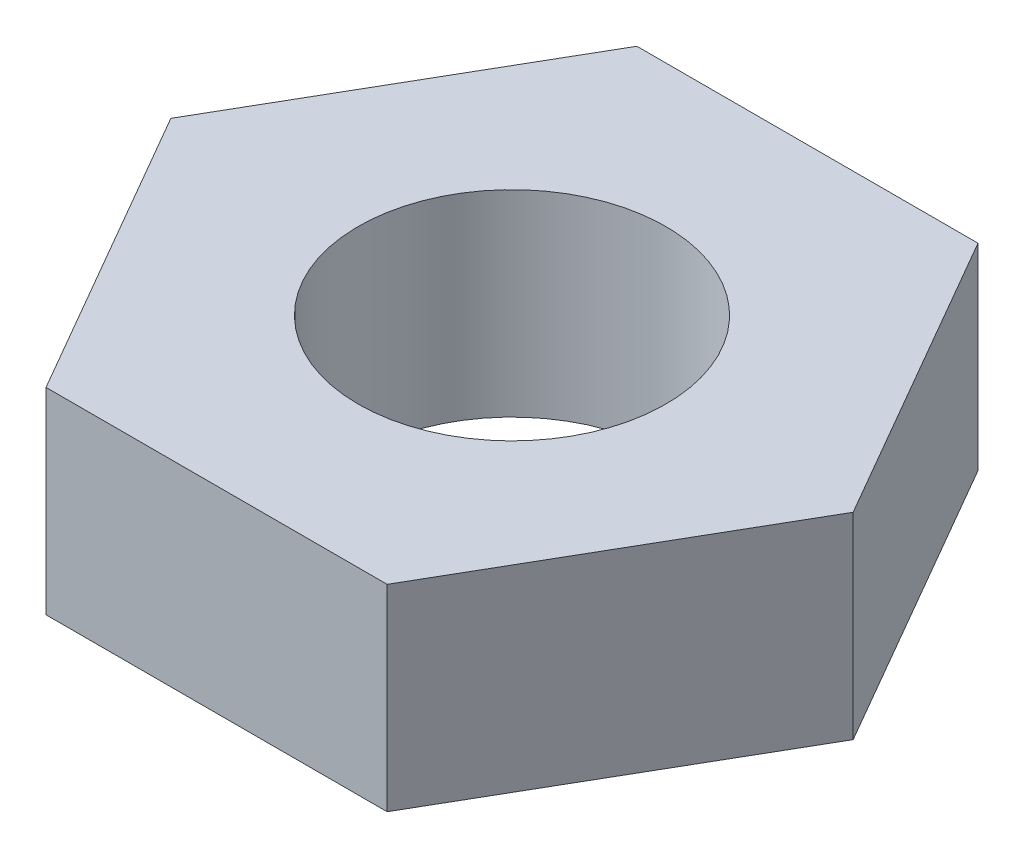
ISO-10303-21;
HEADER;
FILE_DESCRIPTION(('STEP AP214'),'2;1');
FILE_NAME('part.step','',(''),(''),'','','');
FILE_SCHEMA(('AUTOMOTIVE_DESIGN { 1 0 10303 214 1 1 1 1 }'));
ENDSEC;
DATA;
#1=APPLICATION_CONTEXT('core data for automotive mechanical design processes');
#2=APPLICATION_PROTOCOL_DEFINITION('international standard','automotive_design',2000,#1);
#3=PRODUCT_CONTEXT('',#1,'mechanical');
#4=PRODUCT('Part','Part','',(#3));
#5=PRODUCT_RELATED_PRODUCT_CATEGORY('part','',(#4));
#6=PRODUCT_DEFINITION_FORMATION('','',#4);
#7=PRODUCT_DEFINITION_CONTEXT('part definition',#1,'design');
#8=PRODUCT_DEFINITION('design','',#6,#7);
#9=PRODUCT_DEFINITION_SHAPE('','',#8);
#10=(LENGTH_UNIT() NAMED_UNIT(*) SI_UNIT(.MILLI.,.METRE.));
#11=(NAMED_UNIT(*) PLANE_ANGLE_UNIT() SI_UNIT($,.RADIAN.));
#12=(NAMED_UNIT(*) SI_UNIT($,.STERADIAN.) SOLID_ANGLE_UNIT());
#13=UNCERTAINTY_MEASURE_WITH_UNIT(LENGTH_MEASURE(1.E-05),#10,'distance_accuracy_value','');
#14=(GEOMETRIC_REPRESENTATION_CONTEXT(3) GLOBAL_UNCERTAINTY_ASSIGNED_CONTEXT((#13)) GLOBAL_UNIT_ASSIGNED_CONTEXT((#10,
#11,#12)) REPRESENTATION_CONTEXT('',''));
#15=CARTESIAN_POINT('',(0.,0.,0.));
#16=DIRECTION('',(0.,0.,1.));
#17=DIRECTION('',(1.,0.,0.));
#18=AXIS2_PLACEMENT_3D('',#15,#16,#17);
#19=CARTESIAN_POINT('',(10.9985226280624,6.35,0.));
#20=DIRECTION('',(-0.866025403784438,0.,0.5));
#21=DIRECTION('',(0.5,0.,0.866025403784438));
#22=AXIS2_PLACEMENT_3D('',#19,#20,#21);
#23=PLANE('',#22);
#24=DIRECTION('',(-0.5,0.,-0.866025403784438));
#25=VECTOR('',#24,1.);
#26=CARTESIAN_POINT('',(10.9985226280624,0.,0.));
#27=LINE('',#26,#25);
#28=CARTESIAN_POINT('',(10.9985226280624,0.,0.));
#29=VERTEX_POINT('',#28);
#30=CARTESIAN_POINT('',(5.49926131403119,0.,-9.525));
#31=VERTEX_POINT('',#30);
#32=EDGE_CURVE('E124',#29,#31,#27,.T.);
#33=ORIENTED_EDGE('',*,*,#32,.T.);
#34=DIRECTION('',(0.,-1.,0.));
#35=VECTOR('',#34,1.);
#36=CARTESIAN_POINT('',(5.49926131403119,6.35,-9.525));
#37=LINE('',#36,#35);
#38=CARTESIAN_POINT('',(5.49926131403119,6.35,-9.525));
#39=VERTEX_POINT('',#38);
#40=EDGE_CURVE('E11',#39,#31,#37,.T.);
#41=ORIENTED_EDGE('',*,*,#40,.F.);
#42=DIRECTION('',(-0.5,0.,-0.866025403784438));
#43=VECTOR('',#42,1.);
#44=CARTESIAN_POINT('',(10.9985226280624,6.35,0.));
#45=LINE('',#44,#43);
#46=CARTESIAN_POINT('',(10.9985226280624,6.35,0.));
#47=VERTEX_POINT('',#46);
#48=EDGE_CURVE('E135',#47,#39,#45,.T.);
#49=ORIENTED_EDGE('',*,*,#48,.F.);
#50=DIRECTION('',(0.,-1.,0.));
#51=VECTOR('',#50,1.);
#52=CARTESIAN_POINT('',(10.9985226280624,6.35,0.));
#53=LINE('',#52,#51);
#54=EDGE_CURVE('E120',#47,#29,#53,.T.);
#55=ORIENTED_EDGE('',*,*,#54,.T.);
#56=EDGE_LOOP('',(#33,#41,#49,#55));
#57=FACE_BOUND('',#56,.T.);
#58=ADVANCED_FACE('F40',(#57),#23,.F.);
#59=CARTESIAN_POINT('',(5.49926131403119,6.35,-9.525));
#60=DIRECTION('',(0.,0.,1.));
#61=DIRECTION('',(1.,0.,0.));
#62=AXIS2_PLACEMENT_3D('',#59,#60,#61);
#63=PLANE('',#62);
#64=DIRECTION('',(-1.,0.,0.));
#65=VECTOR('',#64,1.);
#66=CARTESIAN_POINT('',(5.49926131403119,0.,-9.525));
#67=LINE('',#66,#65);
#68=CARTESIAN_POINT('',(-5.49926131403119,0.,-9.525));
#69=VERTEX_POINT('',#68);
#70=EDGE_CURVE('E127',#31,#69,#67,.T.);
#71=ORIENTED_EDGE('',*,*,#70,.T.);
#72=DIRECTION('',(0.,-1.,0.));
#73=VECTOR('',#72,1.);
#74=CARTESIAN_POINT('',(-5.49926131403119,6.35,-9.525));
#75=LINE('',#74,#73);
#76=CARTESIAN_POINT('',(-5.49926131403119,6.35,-9.525));
#77=VERTEX_POINT('',#76);
#78=EDGE_CURVE('E48',#77,#69,#75,.T.);
#79=ORIENTED_EDGE('',*,*,#78,.F.);
#80=DIRECTION('',(-1.,0.,0.));
#81=VECTOR('',#80,1.);
#82=CARTESIAN_POINT('',(5.49926131403119,6.35,-9.525));
#83=LINE('',#82,#81);
#84=EDGE_CURVE('E93',#39,#77,#83,.T.);
#85=ORIENTED_EDGE('',*,*,#84,.F.);
#86=ORIENTED_EDGE('',*,*,#40,.T.);
#87=EDGE_LOOP('',(#71,#79,#85,#86));
#88=FACE_BOUND('',#87,.T.);
#89=ADVANCED_FACE('F160',(#88),#63,.F.);
#90=CARTESIAN_POINT('',(-5.49926131403119,6.35,-9.525));
#91=DIRECTION('',(0.866025403784439,0.,0.499999999999999));
#92=DIRECTION('',(0.499999999999999,0.,-0.866025403784439));
#93=AXIS2_PLACEMENT_3D('',#90,#91,#92);
#94=PLANE('',#93);
#95=DIRECTION('',(-0.499999999999999,0.,0.866025403784439));
#96=VECTOR('',#95,1.);
#97=CARTESIAN_POINT('',(-5.49926131403119,0.,-9.525));
#98=LINE('',#97,#96);
#99=CARTESIAN_POINT('',(-10.9985226280624,0.,0.));
#100=VERTEX_POINT('',#99);
#101=EDGE_CURVE('E130',#69,#100,#98,.T.);
#102=ORIENTED_EDGE('',*,*,#101,.T.);
#103=DIRECTION('',(0.,-1.,0.));
#104=VECTOR('',#103,1.);
#105=CARTESIAN_POINT('',(-10.9985226280624,6.35,0.));
#106=LINE('',#105,#104);
#107=CARTESIAN_POINT('',(-10.9985226280624,6.35,0.));
#108=VERTEX_POINT('',#107);
#109=EDGE_CURVE('E115',#108,#100,#106,.T.);
#110=ORIENTED_EDGE('',*,*,#109,.F.);
#111=DIRECTION('',(-0.499999999999999,0.,0.866025403784439));
#112=VECTOR('',#111,1.);
#113=CARTESIAN_POINT('',(-5.49926131403119,6.35,-9.525));
#114=LINE('',#113,#112);
#115=EDGE_CURVE('E106',#77,#108,#114,.T.);
#116=ORIENTED_EDGE('',*,*,#115,.F.);
#117=ORIENTED_EDGE('',*,*,#78,.T.);
#118=EDGE_LOOP('',(#102,#110,#116,#117));
#119=FACE_BOUND('',#118,.T.);
#120=ADVANCED_FACE('F141',(#119),#94,.F.);
#121=CARTESIAN_POINT('',(-10.9985226280624,6.35,0.));
#122=DIRECTION('',(0.866025403784438,0.,-0.5));
#123=DIRECTION('',(-0.5,0.,-0.866025403784438));
#124=AXIS2_PLACEMENT_3D('',#121,#122,#123);
#125=PLANE('',#124);
#126=DIRECTION('',(0.5,0.,0.866025403784438));
#127=VECTOR('',#126,1.);
#128=CARTESIAN_POINT('',(-10.9985226280624,0.,0.));
#129=LINE('',#128,#127);
#130=CARTESIAN_POINT('',(-5.49926131403118,0.,9.525));
#131=VERTEX_POINT('',#130);
#132=EDGE_CURVE('E114',#100,#131,#129,.T.);
#133=ORIENTED_EDGE('',*,*,#132,.T.);
#134=DIRECTION('',(0.,-1.,0.));
#135=VECTOR('',#134,1.);
#136=CARTESIAN_POINT('',(-5.49926131403118,6.35,9.525));
#137=LINE('',#136,#135);
#138=CARTESIAN_POINT('',(-5.49926131403118,6.35,9.525));
#139=VERTEX_POINT('',#138);
#140=EDGE_CURVE('E111',#139,#131,#137,.T.);
#141=ORIENTED_EDGE('',*,*,#140,.F.);
#142=DIRECTION('',(0.5,0.,0.866025403784438));
#143=VECTOR('',#142,1.);
#144=CARTESIAN_POINT('',(-10.9985226280624,6.35,0.));
#145=LINE('',#144,#143);
#146=EDGE_CURVE('E100',#108,#139,#145,.T.);
#147=ORIENTED_EDGE('',*,*,#146,.F.);
#148=ORIENTED_EDGE('',*,*,#109,.T.);
#149=EDGE_LOOP('',(#133,#141,#147,#148));
#150=FACE_BOUND('',#149,.T.);
#151=ADVANCED_FACE('F112',(#150),#125,.F.);
#152=CARTESIAN_POINT('',(-5.49926131403118,6.35,9.525));
#153=DIRECTION('',(0.,0.,-1.));
#154=DIRECTION('',(-1.,0.,0.));
#155=AXIS2_PLACEMENT_3D('',#152,#153,#154);
#156=PLANE('',#155);
#157=DIRECTION('',(1.,0.,0.));
#158=VECTOR('',#157,1.);
#159=CARTESIAN_POINT('',(-5.49926131403118,0.,9.525));
#160=LINE('',#159,#158);
#161=CARTESIAN_POINT('',(5.49926131403119,0.,9.525));
#162=VERTEX_POINT('',#161);
#163=EDGE_CURVE('E79',#131,#162,#160,.T.);
#164=ORIENTED_EDGE('',*,*,#163,.T.);
#165=DIRECTION('',(0.,-1.,0.));
#166=VECTOR('',#165,1.);
#167=CARTESIAN_POINT('',(5.49926131403119,6.35,9.525));
#168=LINE('',#167,#166);
#169=CARTESIAN_POINT('',(5.49926131403119,6.35,9.525));
#170=VERTEX_POINT('',#169);
#171=EDGE_CURVE('E116',#170,#162,#168,.T.);
#172=ORIENTED_EDGE('',*,*,#171,.F.);
#173=DIRECTION('',(1.,0.,0.));
#174=VECTOR('',#173,1.);
#175=CARTESIAN_POINT('',(-5.49926131403118,6.35,9.525));
#176=LINE('',#175,#174);
#177=EDGE_CURVE('E104',#139,#170,#176,.T.);
#178=ORIENTED_EDGE('',*,*,#177,.F.);
#179=ORIENTED_EDGE('',*,*,#140,.T.);
#180=EDGE_LOOP('',(#164,#172,#178,#179));
#181=FACE_BOUND('',#180,.T.);
#182=ADVANCED_FACE('F118',(#181),#156,.F.);
#183=CARTESIAN_POINT('',(5.49926131403119,6.35,9.525));
#184=DIRECTION('',(-0.866025403784439,0.,-0.5));
#185=DIRECTION('',(-0.5,0.,0.866025403784439));
#186=AXIS2_PLACEMENT_3D('',#183,#184,#185);
#187=PLANE('',#186);
#188=DIRECTION('',(0.5,0.,-0.866025403784439));
#189=VECTOR('',#188,1.);
#190=CARTESIAN_POINT('',(5.49926131403119,0.,9.525));
#191=LINE('',#190,#189);
#192=EDGE_CURVE('E85',#162,#29,#191,.T.);
#193=ORIENTED_EDGE('',*,*,#192,.T.);
#194=ORIENTED_EDGE('',*,*,#54,.F.);
#195=DIRECTION('',(0.5,0.,-0.866025403784439));
#196=VECTOR('',#195,1.);
#197=CARTESIAN_POINT('',(5.49926131403119,6.35,9.525));
#198=LINE('',#197,#196);
#199=EDGE_CURVE('E56',#170,#47,#198,.T.);
#200=ORIENTED_EDGE('',*,*,#199,.F.);
#201=ORIENTED_EDGE('',*,*,#171,.T.);
#202=EDGE_LOOP('',(#193,#194,#200,#201));
#203=FACE_BOUND('',#202,.T.);
#204=ADVANCED_FACE('F148',(#203),#187,.F.);
#205=CARTESIAN_POINT('',(0.,6.35,0.));
#206=DIRECTION('',(0.,1.,0.));
#207=DIRECTION('',(0.,0.,1.));
#208=AXIS2_PLACEMENT_3D('',#205,#206,#207);
#209=PLANE('',#208);
#210=CARTESIAN_POINT('',(0.,6.35,0.));
#211=DIRECTION('',(0.,1.,0.));
#212=DIRECTION('',(0.,0.,1.));
#213=AXIS2_PLACEMENT_3D('',#210,#211,#212);
#214=CIRCLE('',#213,4.96061999999999);
#215=CARTESIAN_POINT('',(0.,6.35,4.96061999999999));
#216=VERTEX_POINT('',#215);
#217=EDGE_CURVE('E220',#216,#216,#214,.T.);
#218=ORIENTED_EDGE('',*,*,#217,.F.);
#219=EDGE_LOOP('',(#218));
#220=FACE_BOUND('',#219,.T.);
#221=ORIENTED_EDGE('',*,*,#48,.T.);
#222=ORIENTED_EDGE('',*,*,#84,.T.);
#223=ORIENTED_EDGE('',*,*,#115,.T.);
#224=ORIENTED_EDGE('',*,*,#146,.T.);
#225=ORIENTED_EDGE('',*,*,#177,.T.);
#226=ORIENTED_EDGE('',*,*,#199,.T.);
#227=EDGE_LOOP('',(#221,#222,#223,#224,#225,#226));
#228=FACE_BOUND('',#227,.T.);
#229=ADVANCED_FACE('F102',(#220,#228),#209,.T.);
#230=CARTESIAN_POINT('',(0.,0.,0.));
#231=DIRECTION('',(0.,1.,0.));
#232=DIRECTION('',(0.,0.,1.));
#233=AXIS2_PLACEMENT_3D('',#230,#231,#232);
#234=PLANE('',#233);
#235=CARTESIAN_POINT('',(0.,0.,0.));
#236=DIRECTION('',(0.,1.,0.));
#237=DIRECTION('',(0.,0.,1.));
#238=AXIS2_PLACEMENT_3D('',#235,#236,#237);
#239=CIRCLE('',#238,4.96062);
#240=CARTESIAN_POINT('',(0.,0.,4.96062));
#241=VERTEX_POINT('',#240);
#242=EDGE_CURVE('E128',#241,#241,#239,.T.);
#243=ORIENTED_EDGE('',*,*,#242,.T.);
#244=EDGE_LOOP('',(#243));
#245=FACE_BOUND('',#244,.T.);
#246=ORIENTED_EDGE('',*,*,#32,.F.);
#247=ORIENTED_EDGE('',*,*,#192,.F.);
#248=ORIENTED_EDGE('',*,*,#163,.F.);
#249=ORIENTED_EDGE('',*,*,#132,.F.);
#250=ORIENTED_EDGE('',*,*,#101,.F.);
#251=ORIENTED_EDGE('',*,*,#70,.F.);
#252=EDGE_LOOP('',(#246,#247,#248,#249,#250,#251));
#253=FACE_BOUND('',#252,.T.);
#254=ADVANCED_FACE('F144',(#245,#253),#234,.F.);
#255=CARTESIAN_POINT('',(0.,6.35,0.));
#256=DIRECTION('',(0.,1.,0.));
#257=DIRECTION('',(0.,0.,1.));
#258=AXIS2_PLACEMENT_3D('',#255,#256,#257);
#259=CYLINDRICAL_SURFACE('',#258,4.96061999999999);
#260=ORIENTED_EDGE('',*,*,#242,.F.);
#261=EDGE_LOOP('',(#260));
#262=FACE_BOUND('',#261,.T.);
#263=ORIENTED_EDGE('',*,*,#217,.T.);
#264=EDGE_LOOP('',(#263));
#265=FACE_BOUND('',#264,.T.);
#266=ADVANCED_FACE('F199',(#262,#265),#259,.F.);
#267=CLOSED_SHELL('',(#58,#89,#120,#151,#182,#204,#229,#254,#266));
#268=MANIFOLD_SOLID_BREP('B2',#267);
#269=ADVANCED_BREP_SHAPE_REPRESENTATION('',(#18,#268),#14);
#270=SHAPE_DEFINITION_REPRESENTATION(#9,#269);
ENDSEC;
END-ISO-10303-21;
